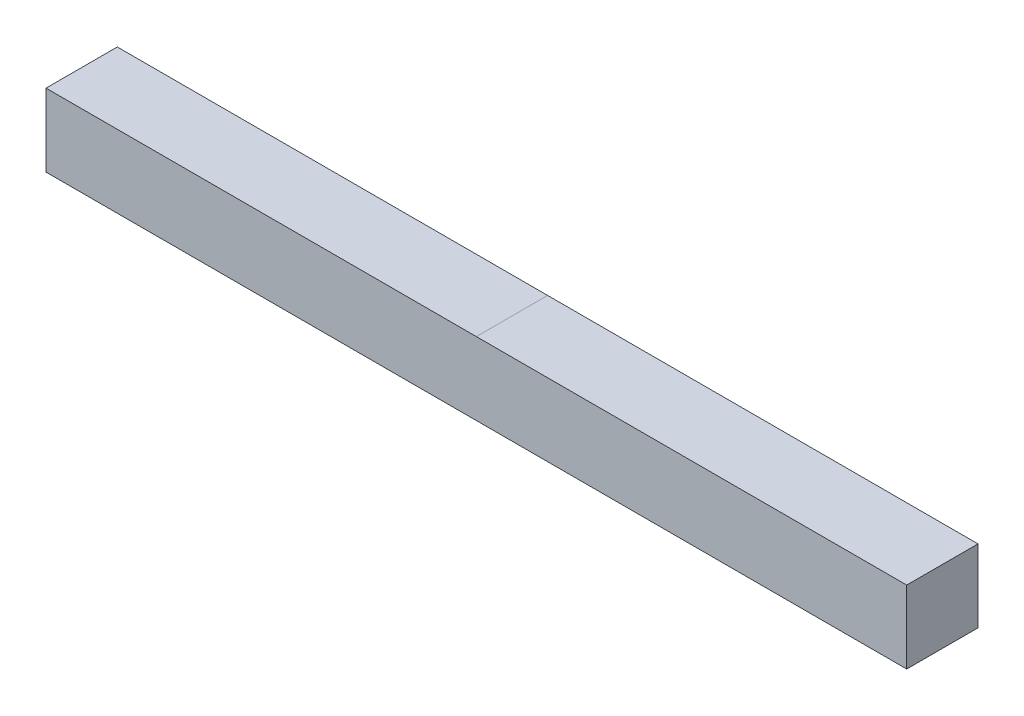
ISO-10303-21;
HEADER;
FILE_DESCRIPTION(('STEP AP214'),'2;1');
FILE_NAME('part.step','',(''),(''),'','','');
FILE_SCHEMA(('AUTOMOTIVE_DESIGN { 1 0 10303 214 1 1 1 1 }'));
ENDSEC;
DATA;
#1=APPLICATION_CONTEXT('core data for automotive mechanical design processes');
#2=APPLICATION_PROTOCOL_DEFINITION('international standard','automotive_design',2000,#1);
#3=PRODUCT_CONTEXT('',#1,'mechanical');
#4=PRODUCT('Part','Part','',(#3));
#5=PRODUCT_RELATED_PRODUCT_CATEGORY('part','',(#4));
#6=PRODUCT_DEFINITION_FORMATION('','',#4);
#7=PRODUCT_DEFINITION_CONTEXT('part definition',#1,'design');
#8=PRODUCT_DEFINITION('design','',#6,#7);
#9=PRODUCT_DEFINITION_SHAPE('','',#8);
#10=(LENGTH_UNIT() NAMED_UNIT(*) SI_UNIT(.MILLI.,.METRE.));
#11=(NAMED_UNIT(*) PLANE_ANGLE_UNIT() SI_UNIT($,.RADIAN.));
#12=(NAMED_UNIT(*) SI_UNIT($,.STERADIAN.) SOLID_ANGLE_UNIT());
#13=UNCERTAINTY_MEASURE_WITH_UNIT(LENGTH_MEASURE(1.E-05),#10,'distance_accuracy_value','');
#14=(GEOMETRIC_REPRESENTATION_CONTEXT(3) GLOBAL_UNCERTAINTY_ASSIGNED_CONTEXT((#13)) GLOBAL_UNIT_ASSIGNED_CONTEXT((#10,
#11,#12)) REPRESENTATION_CONTEXT('',''));
#15=CARTESIAN_POINT('',(0.,0.,0.));
#16=DIRECTION('',(0.,0.,1.));
#17=DIRECTION('',(1.,0.,0.));
#18=AXIS2_PLACEMENT_3D('',#15,#16,#17);
#19=CARTESIAN_POINT('',(76.2,6.4389,6.3119));
#20=DIRECTION('',(0.,1.,0.));
#21=DIRECTION('',(0.,0.,1.));
#22=AXIS2_PLACEMENT_3D('',#19,#20,#21);
#23=PLANE('',#22);
#24=DIRECTION('',(-1.,0.,0.));
#25=VECTOR('',#24,1.);
#26=CARTESIAN_POINT('',(76.2,6.4389,6.3119));
#27=LINE('',#26,#25);
#28=CARTESIAN_POINT('',(0.,6.4389,6.3119));
#29=VERTEX_POINT('',#28);
#30=CARTESIAN_POINT('',(-76.2,6.4389,6.3119));
#31=VERTEX_POINT('',#30);
#32=EDGE_CURVE('E104',#29,#31,#27,.T.);
#33=ORIENTED_EDGE('',*,*,#32,.F.);
#34=DIRECTION('',(0.,0.,-1.));
#35=VECTOR('',#34,1.);
#36=CARTESIAN_POINT('',(0.,6.4389,6.3119));
#37=LINE('',#36,#35);
#38=CARTESIAN_POINT('',(0.,6.4389,-6.3119));
#39=VERTEX_POINT('',#38);
#40=EDGE_CURVE('E12',#29,#39,#37,.T.);
#41=ORIENTED_EDGE('',*,*,#40,.T.);
#42=DIRECTION('',(-1.,0.,0.));
#43=VECTOR('',#42,1.);
#44=CARTESIAN_POINT('',(76.2,6.4389,-6.3119));
#45=LINE('',#44,#43);
#46=CARTESIAN_POINT('',(-76.2,6.4389,-6.3119));
#47=VERTEX_POINT('',#46);
#48=EDGE_CURVE('E103',#39,#47,#45,.T.);
#49=ORIENTED_EDGE('',*,*,#48,.T.);
#50=DIRECTION('',(0.,0.,-1.));
#51=VECTOR('',#50,1.);
#52=CARTESIAN_POINT('',(-76.2,6.4389,6.3119));
#53=LINE('',#52,#51);
#54=EDGE_CURVE('E131',#31,#47,#53,.T.);
#55=ORIENTED_EDGE('',*,*,#54,.F.);
#56=EDGE_LOOP('',(#33,#41,#49,#55));
#57=FACE_BOUND('',#56,.T.);
#58=ADVANCED_FACE('F43',(#57),#23,.T.);
#59=CARTESIAN_POINT('',(76.2,-6.4389,6.3119));
#60=DIRECTION('',(0.,1.,0.));
#61=DIRECTION('',(0.,0.,1.));
#62=AXIS2_PLACEMENT_3D('',#59,#60,#61);
#63=PLANE('',#62);
#64=DIRECTION('',(-1.,0.,0.));
#65=VECTOR('',#64,1.);
#66=CARTESIAN_POINT('',(76.2,-6.4389,6.3119));
#67=LINE('',#66,#65);
#68=CARTESIAN_POINT('',(63.5,-6.4389,6.3119));
#69=VERTEX_POINT('',#68);
#70=CARTESIAN_POINT('',(-63.4999999999999,-6.4389,6.3119));
#71=VERTEX_POINT('',#70);
#72=EDGE_CURVE('E138',#69,#71,#67,.T.);
#73=ORIENTED_EDGE('',*,*,#72,.T.);
#74=DIRECTION('',(0.,0.,-1.));
#75=VECTOR('',#74,1.);
#76=CARTESIAN_POINT('',(-63.5,-6.4389,6.3119));
#77=LINE('',#76,#75);
#78=CARTESIAN_POINT('',(-63.4999999999999,-6.4389,-6.3119));
#79=VERTEX_POINT('',#78);
#80=EDGE_CURVE('E51',#71,#79,#77,.T.);
#81=ORIENTED_EDGE('',*,*,#80,.T.);
#82=DIRECTION('',(-1.,0.,0.));
#83=VECTOR('',#82,1.);
#84=CARTESIAN_POINT('',(76.2,-6.4389,-6.3119));
#85=LINE('',#84,#83);
#86=CARTESIAN_POINT('',(63.5,-6.4389,-6.3119));
#87=VERTEX_POINT('',#86);
#88=EDGE_CURVE('E143',#87,#79,#85,.T.);
#89=ORIENTED_EDGE('',*,*,#88,.F.);
#90=DIRECTION('',(0.,0.,-1.));
#91=VECTOR('',#90,1.);
#92=CARTESIAN_POINT('',(63.5,-6.4389,6.3119));
#93=LINE('',#92,#91);
#94=EDGE_CURVE('E137',#69,#87,#93,.T.);
#95=ORIENTED_EDGE('',*,*,#94,.F.);
#96=EDGE_LOOP('',(#73,#81,#89,#95));
#97=FACE_BOUND('',#96,.T.);
#98=ADVANCED_FACE('F151',(#97),#63,.F.);
#99=CARTESIAN_POINT('',(76.2,-6.4389,6.3119));
#100=VERTEX_POINT('',#99);
#101=EDGE_CURVE('E117',#100,#69,#67,.T.);
#102=ORIENTED_EDGE('',*,*,#101,.T.);
#103=ORIENTED_EDGE('',*,*,#94,.T.);
#104=CARTESIAN_POINT('',(76.2,-6.4389,-6.3119));
#105=VERTEX_POINT('',#104);
#106=EDGE_CURVE('E140',#105,#87,#85,.T.);
#107=ORIENTED_EDGE('',*,*,#106,.F.);
#108=DIRECTION('',(0.,0.,-1.));
#109=VECTOR('',#108,1.);
#110=CARTESIAN_POINT('',(76.2,-6.4389,6.3119));
#111=LINE('',#110,#109);
#112=EDGE_CURVE('E126',#100,#105,#111,.T.);
#113=ORIENTED_EDGE('',*,*,#112,.F.);
#114=EDGE_LOOP('',(#102,#103,#107,#113));
#115=FACE_BOUND('',#114,.T.);
#116=ADVANCED_FACE('F162',(#115),#63,.F.);
#117=CARTESIAN_POINT('',(76.2,-6.4389,6.3119));
#118=DIRECTION('',(0.,0.,1.));
#119=DIRECTION('',(1.,0.,0.));
#120=AXIS2_PLACEMENT_3D('',#117,#118,#119);
#121=PLANE('',#120);
#122=DIRECTION('',(0.,1.,0.));
#123=VECTOR('',#122,1.);
#124=CARTESIAN_POINT('',(-76.2,-6.4389,6.3119));
#125=LINE('',#124,#123);
#126=CARTESIAN_POINT('',(-76.2,-6.4389,6.3119));
#127=VERTEX_POINT('',#126);
#128=EDGE_CURVE('E128',#127,#31,#125,.T.);
#129=ORIENTED_EDGE('',*,*,#128,.F.);
#130=EDGE_CURVE('E139',#71,#127,#67,.T.);
#131=ORIENTED_EDGE('',*,*,#130,.F.);
#132=ORIENTED_EDGE('',*,*,#72,.F.);
#133=ORIENTED_EDGE('',*,*,#101,.F.);
#134=DIRECTION('',(0.,1.,0.));
#135=VECTOR('',#134,1.);
#136=CARTESIAN_POINT('',(76.2,-6.4389,6.3119));
#137=LINE('',#136,#135);
#138=CARTESIAN_POINT('',(76.2,6.4389,6.3119));
#139=VERTEX_POINT('',#138);
#140=EDGE_CURVE('E109',#100,#139,#137,.T.);
#141=ORIENTED_EDGE('',*,*,#140,.T.);
#142=EDGE_CURVE('E97',#139,#29,#27,.T.);
#143=ORIENTED_EDGE('',*,*,#142,.T.);
#144=ORIENTED_EDGE('',*,*,#32,.T.);
#145=EDGE_LOOP('',(#129,#131,#132,#133,#141,#143,#144));
#146=FACE_BOUND('',#145,.T.);
#147=ADVANCED_FACE('F45',(#146),#121,.T.);
#148=ORIENTED_EDGE('',*,*,#80,.F.);
#149=ORIENTED_EDGE('',*,*,#130,.T.);
#150=DIRECTION('',(0.,0.,-1.));
#151=VECTOR('',#150,1.);
#152=CARTESIAN_POINT('',(-76.2,-6.4389,6.3119));
#153=LINE('',#152,#151);
#154=CARTESIAN_POINT('',(-76.2,-6.4389,-6.3119));
#155=VERTEX_POINT('',#154);
#156=EDGE_CURVE('E119',#127,#155,#153,.T.);
#157=ORIENTED_EDGE('',*,*,#156,.T.);
#158=EDGE_CURVE('E144',#79,#155,#85,.T.);
#159=ORIENTED_EDGE('',*,*,#158,.F.);
#160=EDGE_LOOP('',(#148,#149,#157,#159));
#161=FACE_BOUND('',#160,.T.);
#162=ADVANCED_FACE('F155',(#161),#63,.F.);
#163=CARTESIAN_POINT('',(76.2,-6.4389,-6.3119));
#164=DIRECTION('',(0.,0.,1.));
#165=DIRECTION('',(1.,0.,0.));
#166=AXIS2_PLACEMENT_3D('',#163,#164,#165);
#167=PLANE('',#166);
#168=DIRECTION('',(0.,1.,0.));
#169=VECTOR('',#168,1.);
#170=CARTESIAN_POINT('',(-76.2,-6.4389,-6.3119));
#171=LINE('',#170,#169);
#172=EDGE_CURVE('E122',#155,#47,#171,.T.);
#173=ORIENTED_EDGE('',*,*,#172,.T.);
#174=ORIENTED_EDGE('',*,*,#48,.F.);
#175=CARTESIAN_POINT('',(76.2,6.4389,-6.3119));
#176=VERTEX_POINT('',#175);
#177=EDGE_CURVE('E145',#176,#39,#45,.T.);
#178=ORIENTED_EDGE('',*,*,#177,.F.);
#179=DIRECTION('',(0.,1.,0.));
#180=VECTOR('',#179,1.);
#181=CARTESIAN_POINT('',(76.2,-6.4389,-6.3119));
#182=LINE('',#181,#180);
#183=EDGE_CURVE('E111',#105,#176,#182,.T.);
#184=ORIENTED_EDGE('',*,*,#183,.F.);
#185=ORIENTED_EDGE('',*,*,#106,.T.);
#186=ORIENTED_EDGE('',*,*,#88,.T.);
#187=ORIENTED_EDGE('',*,*,#158,.T.);
#188=EDGE_LOOP('',(#173,#174,#178,#184,#185,#186,#187));
#189=FACE_BOUND('',#188,.T.);
#190=ADVANCED_FACE('F159',(#189),#167,.F.);
#191=ORIENTED_EDGE('',*,*,#40,.F.);
#192=ORIENTED_EDGE('',*,*,#142,.F.);
#193=DIRECTION('',(0.,0.,-1.));
#194=VECTOR('',#193,1.);
#195=CARTESIAN_POINT('',(76.2,6.4389,6.3119));
#196=LINE('',#195,#194);
#197=EDGE_CURVE('E100',#139,#176,#196,.T.);
#198=ORIENTED_EDGE('',*,*,#197,.T.);
#199=ORIENTED_EDGE('',*,*,#177,.T.);
#200=EDGE_LOOP('',(#191,#192,#198,#199));
#201=FACE_BOUND('',#200,.T.);
#202=ADVANCED_FACE('F99',(#201),#23,.T.);
#203=CARTESIAN_POINT('',(76.2,0.,0.));
#204=DIRECTION('',(-1.,0.,0.));
#205=DIRECTION('',(0.,0.,1.));
#206=AXIS2_PLACEMENT_3D('',#203,#204,#205);
#207=PLANE('',#206);
#208=ORIENTED_EDGE('',*,*,#140,.F.);
#209=ORIENTED_EDGE('',*,*,#112,.T.);
#210=ORIENTED_EDGE('',*,*,#183,.T.);
#211=ORIENTED_EDGE('',*,*,#197,.F.);
#212=EDGE_LOOP('',(#208,#209,#210,#211));
#213=FACE_BOUND('',#212,.T.);
#214=ADVANCED_FACE('F108',(#213),#207,.F.);
#215=CARTESIAN_POINT('',(-76.2,0.,0.));
#216=DIRECTION('',(-1.,0.,0.));
#217=DIRECTION('',(0.,0.,1.));
#218=AXIS2_PLACEMENT_3D('',#215,#216,#217);
#219=PLANE('',#218);
#220=ORIENTED_EDGE('',*,*,#128,.T.);
#221=ORIENTED_EDGE('',*,*,#54,.T.);
#222=ORIENTED_EDGE('',*,*,#172,.F.);
#223=ORIENTED_EDGE('',*,*,#156,.F.);
#224=EDGE_LOOP('',(#220,#221,#222,#223));
#225=FACE_BOUND('',#224,.T.);
#226=ADVANCED_FACE('F164',(#225),#219,.T.);
#227=CLOSED_SHELL('',(#58,#98,#116,#147,#162,#190,#202,#214,#226));
#228=MANIFOLD_SOLID_BREP('B2',#227);
#229=ADVANCED_BREP_SHAPE_REPRESENTATION('',(#18,#228),#14);
#230=SHAPE_DEFINITION_REPRESENTATION(#9,#229);
ENDSEC;
END-ISO-10303-21;
